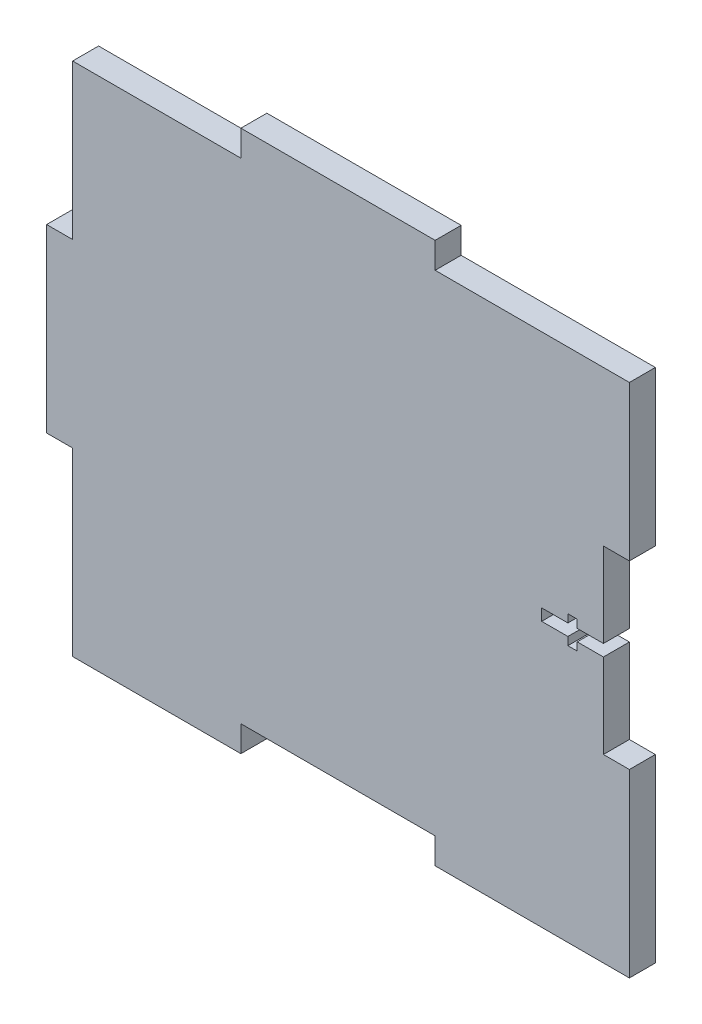
ISO-10303-21;
HEADER;
FILE_DESCRIPTION(('STEP AP214'),'2;1');
FILE_NAME('part.step','',(''),(''),'','','');
FILE_SCHEMA(('AUTOMOTIVE_DESIGN { 1 0 10303 214 1 1 1 1 }'));
ENDSEC;
DATA;
#1=APPLICATION_CONTEXT('core data for automotive mechanical design processes');
#2=APPLICATION_PROTOCOL_DEFINITION('international standard','automotive_design',2000,#1);
#3=PRODUCT_CONTEXT('',#1,'mechanical');
#4=PRODUCT('Part','Part','',(#3));
#5=PRODUCT_RELATED_PRODUCT_CATEGORY('part','',(#4));
#6=PRODUCT_DEFINITION_FORMATION('','',#4);
#7=PRODUCT_DEFINITION_CONTEXT('part definition',#1,'design');
#8=PRODUCT_DEFINITION('design','',#6,#7);
#9=PRODUCT_DEFINITION_SHAPE('','',#8);
#10=(LENGTH_UNIT() NAMED_UNIT(*) SI_UNIT(.MILLI.,.METRE.));
#11=(NAMED_UNIT(*) PLANE_ANGLE_UNIT() SI_UNIT($,.RADIAN.));
#12=(NAMED_UNIT(*) SI_UNIT($,.STERADIAN.) SOLID_ANGLE_UNIT());
#13=UNCERTAINTY_MEASURE_WITH_UNIT(LENGTH_MEASURE(1.E-05),#10,'distance_accuracy_value','');
#14=(GEOMETRIC_REPRESENTATION_CONTEXT(3) GLOBAL_UNCERTAINTY_ASSIGNED_CONTEXT((#13)) GLOBAL_UNIT_ASSIGNED_CONTEXT((#10,
#11,#12)) REPRESENTATION_CONTEXT('',''));
#15=CARTESIAN_POINT('',(0.,0.,0.));
#16=DIRECTION('',(0.,0.,1.));
#17=DIRECTION('',(1.,0.,0.));
#18=AXIS2_PLACEMENT_3D('',#15,#16,#17);
#19=CARTESIAN_POINT('',(64.9732,-60.4012,5.7912));
#20=DIRECTION('',(-1.,0.,0.));
#21=DIRECTION('',(0.,0.,1.));
#22=AXIS2_PLACEMENT_3D('',#19,#20,#21);
#23=PLANE('',#22);
#24=DIRECTION('',(0.,0.,1.));
#25=VECTOR('',#24,1.);
#26=CARTESIAN_POINT('',(64.9732000000014,54.609999999998,9.78384040450919E-13));
#27=LINE('',#26,#25);
#28=CARTESIAN_POINT('',(64.9732000000014,54.609999999998,9.78384040450919E-13));
#29=VERTEX_POINT('',#28);
#30=CARTESIAN_POINT('',(64.9732000000014,54.6099999999979,5.7912));
#31=VERTEX_POINT('',#30);
#32=EDGE_CURVE('E304',#29,#31,#27,.T.);
#33=ORIENTED_EDGE('',*,*,#32,.T.);
#34=DIRECTION('',(0.,1.,0.));
#35=VECTOR('',#34,1.);
#36=CARTESIAN_POINT('',(64.9732,-60.4012,5.7912));
#37=LINE('',#36,#35);
#38=CARTESIAN_POINT('',(64.9732,20.1337333333333,5.7912));
#39=VERTEX_POINT('',#38);
#40=EDGE_CURVE('E447',#39,#31,#37,.T.);
#41=ORIENTED_EDGE('',*,*,#40,.F.);
#42=DIRECTION('',(0.,0.,-1.));
#43=VECTOR('',#42,1.);
#44=CARTESIAN_POINT('',(64.9732,20.1337333333333,5.7912));
#45=LINE('',#44,#43);
#46=CARTESIAN_POINT('',(64.9732,20.1337333333333,0.));
#47=VERTEX_POINT('',#46);
#48=EDGE_CURVE('E406',#39,#47,#45,.T.);
#49=ORIENTED_EDGE('',*,*,#48,.T.);
#50=DIRECTION('',(0.,1.,0.));
#51=VECTOR('',#50,1.);
#52=CARTESIAN_POINT('',(64.9732,-60.4012,0.));
#53=LINE('',#52,#51);
#54=EDGE_CURVE('E435',#47,#29,#53,.T.);
#55=ORIENTED_EDGE('',*,*,#54,.T.);
#56=EDGE_LOOP('',(#33,#41,#49,#55));
#57=FACE_BOUND('',#56,.T.);
#58=ADVANCED_FACE('F35',(#57),#23,.F.);
#59=CARTESIAN_POINT('',(-64.9732,60.4012,5.7912));
#60=DIRECTION('',(0.,-1.,0.));
#61=DIRECTION('',(0.,0.,-1.));
#62=AXIS2_PLACEMENT_3D('',#59,#60,#61);
#63=PLANE('',#62);
#64=DIRECTION('',(0.,0.,1.));
#65=VECTOR('',#64,1.);
#66=CARTESIAN_POINT('',(21.6577333333347,60.401199999998,9.85322934354826E-13));
#67=LINE('',#66,#65);
#68=CARTESIAN_POINT('',(21.6577333333347,60.401199999998,9.85322934354826E-13));
#69=VERTEX_POINT('',#68);
#70=CARTESIAN_POINT('',(21.6577333333347,60.401199999998,5.79120000000098));
#71=VERTEX_POINT('',#70);
#72=EDGE_CURVE('E283',#69,#71,#67,.T.);
#73=ORIENTED_EDGE('',*,*,#72,.F.);
#74=DIRECTION('',(-1.,0.,0.));
#75=VECTOR('',#74,1.);
#76=CARTESIAN_POINT('',(-64.9732,60.4012,0.));
#77=LINE('',#76,#75);
#78=CARTESIAN_POINT('',(-21.657733333332,60.401199999998,9.57567358739198E-13));
#79=VERTEX_POINT('',#78);
#80=EDGE_CURVE('E458',#69,#79,#77,.T.);
#81=ORIENTED_EDGE('',*,*,#80,.T.);
#82=DIRECTION('',(0.,0.,-1.));
#83=VECTOR('',#82,1.);
#84=CARTESIAN_POINT('',(-21.657733333332,60.401199999998,9.57567358739198E-13));
#85=LINE('',#84,#83);
#86=CARTESIAN_POINT('',(-21.657733333332,60.401199999998,5.79120000000095));
#87=VERTEX_POINT('',#86);
#88=EDGE_CURVE('E285',#87,#79,#85,.T.);
#89=ORIENTED_EDGE('',*,*,#88,.F.);
#90=DIRECTION('',(-1.,0.,0.));
#91=VECTOR('',#90,1.);
#92=CARTESIAN_POINT('',(-64.9732,60.4012,5.7912));
#93=LINE('',#92,#91);
#94=EDGE_CURVE('E446',#71,#87,#93,.T.);
#95=ORIENTED_EDGE('',*,*,#94,.F.);
#96=EDGE_LOOP('',(#73,#81,#89,#95));
#97=FACE_BOUND('',#96,.T.);
#98=ADVANCED_FACE('F525',(#97),#63,.F.);
#99=CARTESIAN_POINT('',(-64.9732,-60.4012,5.7912));
#100=DIRECTION('',(1.,0.,0.));
#101=DIRECTION('',(0.,0.,-1.));
#102=AXIS2_PLACEMENT_3D('',#99,#100,#101);
#103=PLANE('',#102);
#104=DIRECTION('',(0.,0.,1.));
#105=VECTOR('',#104,1.);
#106=CARTESIAN_POINT('',(-64.9732,-20.1337333333354,5.48172618408671E-13));
#107=LINE('',#106,#105);
#108=CARTESIAN_POINT('',(-64.9732,-20.1337333333354,0.));
#109=VERTEX_POINT('',#108);
#110=CARTESIAN_POINT('',(-64.9732,-20.1337333333354,5.79120000000054));
#111=VERTEX_POINT('',#110);
#112=EDGE_CURVE('E535',#109,#111,#107,.T.);
#113=ORIENTED_EDGE('',*,*,#112,.T.);
#114=DIRECTION('',(0.,-1.,0.));
#115=VECTOR('',#114,1.);
#116=CARTESIAN_POINT('',(-64.9732,-60.4012,5.7912));
#117=LINE('',#116,#115);
#118=CARTESIAN_POINT('',(-64.9731999999999,20.1337333333312,5.79120000000072));
#119=VERTEX_POINT('',#118);
#120=EDGE_CURVE('E270',#119,#111,#117,.T.);
#121=ORIENTED_EDGE('',*,*,#120,.F.);
#122=DIRECTION('',(0.,0.,-1.));
#123=VECTOR('',#122,1.);
#124=CARTESIAN_POINT('',(-64.9731999999999,20.1337333333313,7.28583859910259E-13));
#125=LINE('',#124,#123);
#126=CARTESIAN_POINT('',(-64.9731999999999,20.1337333333313,7.28583859910259E-13));
#127=VERTEX_POINT('',#126);
#128=EDGE_CURVE('E264',#119,#127,#125,.T.);
#129=ORIENTED_EDGE('',*,*,#128,.T.);
#130=DIRECTION('',(0.,-1.,0.));
#131=VECTOR('',#130,1.);
#132=CARTESIAN_POINT('',(-64.9732,-60.4012,0.));
#133=LINE('',#132,#131);
#134=EDGE_CURVE('E461',#127,#109,#133,.T.);
#135=ORIENTED_EDGE('',*,*,#134,.T.);
#136=EDGE_LOOP('',(#113,#121,#129,#135));
#137=FACE_BOUND('',#136,.T.);
#138=ADVANCED_FACE('F534',(#137),#103,.F.);
#139=CARTESIAN_POINT('',(0.,0.,5.7912));
#140=DIRECTION('',(0.,0.,-1.));
#141=DIRECTION('',(-1.,0.,0.));
#142=AXIS2_PLACEMENT_3D('',#139,#140,#141);
#143=PLANE('',#142);
#144=DIRECTION('',(-1.,0.,0.));
#145=VECTOR('',#144,1.);
#146=CARTESIAN_POINT('',(-59.182,-20.1337333333354,5.79120000000054));
#147=LINE('',#146,#145);
#148=CARTESIAN_POINT('',(-59.182,-20.1337333333354,5.79120000000054));
#149=VERTEX_POINT('',#148);
#150=EDGE_CURVE('E259',#149,#111,#147,.T.);
#151=ORIENTED_EDGE('',*,*,#150,.F.);
#152=DIRECTION('',(0.,-1.,0.));
#153=VECTOR('',#152,1.);
#154=CARTESIAN_POINT('',(-59.1819999999999,1.49890030942679E-13,5.7912));
#155=LINE('',#154,#153);
#156=CARTESIAN_POINT('',(-59.1820000000001,-60.4012000000021,5.79120000000002));
#157=VERTEX_POINT('',#156);
#158=EDGE_CURVE('E244',#149,#157,#155,.T.);
#159=ORIENTED_EDGE('',*,*,#158,.T.);
#160=DIRECTION('',(1.,0.,0.));
#161=VECTOR('',#160,1.);
#162=CARTESIAN_POINT('',(-64.9732,-60.4012,5.7912));
#163=LINE('',#162,#161);
#164=CARTESIAN_POINT('',(-21.6577333333333,-60.4012,5.7912));
#165=VERTEX_POINT('',#164);
#166=EDGE_CURVE('E452',#157,#165,#163,.T.);
#167=ORIENTED_EDGE('',*,*,#166,.T.);
#168=DIRECTION('',(0.,1.,0.));
#169=VECTOR('',#168,1.);
#170=CARTESIAN_POINT('',(-21.6577333333333,-60.4012,5.7912));
#171=LINE('',#170,#169);
#172=CARTESIAN_POINT('',(-21.6577333333333,-54.61,5.7912));
#173=VERTEX_POINT('',#172);
#174=EDGE_CURVE('E419',#165,#173,#171,.T.);
#175=ORIENTED_EDGE('',*,*,#174,.T.);
#176=DIRECTION('',(1.,0.,0.));
#177=VECTOR('',#176,1.);
#178=CARTESIAN_POINT('',(21.6577333333333,-54.61,5.7912));
#179=LINE('',#178,#177);
#180=CARTESIAN_POINT('',(21.6577333333333,-54.61,5.7912));
#181=VERTEX_POINT('',#180);
#182=EDGE_CURVE('E423',#173,#181,#179,.T.);
#183=ORIENTED_EDGE('',*,*,#182,.T.);
#184=DIRECTION('',(0.,-1.,0.));
#185=VECTOR('',#184,1.);
#186=CARTESIAN_POINT('',(21.6577333333333,-60.4012,5.7912));
#187=LINE('',#186,#185);
#188=CARTESIAN_POINT('',(21.6577333333333,-60.4012,5.7912));
#189=VERTEX_POINT('',#188);
#190=EDGE_CURVE('E416',#181,#189,#187,.T.);
#191=ORIENTED_EDGE('',*,*,#190,.T.);
#192=CARTESIAN_POINT('',(64.9732,-60.4012,5.7912));
#193=VERTEX_POINT('',#192);
#194=EDGE_CURVE('E451',#189,#193,#163,.T.);
#195=ORIENTED_EDGE('',*,*,#194,.T.);
#196=CARTESIAN_POINT('',(64.9732,-20.1337333333333,5.7912));
#197=VERTEX_POINT('',#196);
#198=EDGE_CURVE('E443',#193,#197,#37,.T.);
#199=ORIENTED_EDGE('',*,*,#198,.T.);
#200=DIRECTION('',(-1.,0.,0.));
#201=VECTOR('',#200,1.);
#202=CARTESIAN_POINT('',(64.9732,-20.1337333333333,5.7912));
#203=LINE('',#202,#201);
#204=CARTESIAN_POINT('',(59.182,-20.1337333333333,5.7912));
#205=VERTEX_POINT('',#204);
#206=EDGE_CURVE('E387',#197,#205,#203,.T.);
#207=ORIENTED_EDGE('',*,*,#206,.T.);
#208=DIRECTION('',(0.,1.,0.));
#209=VECTOR('',#208,1.);
#210=CARTESIAN_POINT('',(59.182,20.1337333333333,5.7912));
#211=LINE('',#210,#209);
#212=CARTESIAN_POINT('',(59.182,-1.30175,5.7912));
#213=VERTEX_POINT('',#212);
#214=EDGE_CURVE('E392',#205,#213,#211,.T.);
#215=ORIENTED_EDGE('',*,*,#214,.T.);
#216=DIRECTION('',(-1.,0.,0.));
#217=VECTOR('',#216,1.);
#218=CARTESIAN_POINT('',(59.182,-1.30175,5.7912));
#219=LINE('',#218,#217);
#220=CARTESIAN_POINT('',(53.34,-1.30175,5.7912));
#221=VERTEX_POINT('',#220);
#222=EDGE_CURVE('E355',#213,#221,#219,.T.);
#223=ORIENTED_EDGE('',*,*,#222,.T.);
#224=DIRECTION('',(0.,-1.,0.));
#225=VECTOR('',#224,1.);
#226=CARTESIAN_POINT('',(53.34,3.08609999999997,5.7912));
#227=LINE('',#226,#225);
#228=CARTESIAN_POINT('',(53.34,-3.08610000000003,5.7912));
#229=VERTEX_POINT('',#228);
#230=EDGE_CURVE('E319',#221,#229,#227,.T.);
#231=ORIENTED_EDGE('',*,*,#230,.T.);
#232=DIRECTION('',(-1.,0.,0.));
#233=VECTOR('',#232,1.);
#234=CARTESIAN_POINT('',(51.2572,-3.08610000000003,5.7912));
#235=LINE('',#234,#233);
#236=CARTESIAN_POINT('',(51.2572,-3.08610000000003,5.7912));
#237=VERTEX_POINT('',#236);
#238=EDGE_CURVE('E323',#229,#237,#235,.T.);
#239=ORIENTED_EDGE('',*,*,#238,.T.);
#240=DIRECTION('',(0.,1.,0.));
#241=VECTOR('',#240,1.);
#242=CARTESIAN_POINT('',(51.2572,3.08609999999997,5.7912));
#243=LINE('',#242,#241);
#244=CARTESIAN_POINT('',(51.2572,-1.30175,5.7912));
#245=VERTEX_POINT('',#244);
#246=EDGE_CURVE('E312',#237,#245,#243,.T.);
#247=ORIENTED_EDGE('',*,*,#246,.T.);
#248=CARTESIAN_POINT('',(45.4152,-1.30175,5.7912));
#249=VERTEX_POINT('',#248);
#250=EDGE_CURVE('E359',#245,#249,#219,.T.);
#251=ORIENTED_EDGE('',*,*,#250,.T.);
#252=DIRECTION('',(0.,1.,0.));
#253=VECTOR('',#252,1.);
#254=CARTESIAN_POINT('',(45.4152,1.30175,5.7912));
#255=LINE('',#254,#253);
#256=CARTESIAN_POINT('',(45.4152,1.30175,5.7912));
#257=VERTEX_POINT('',#256);
#258=EDGE_CURVE('E358',#249,#257,#255,.T.);
#259=ORIENTED_EDGE('',*,*,#258,.T.);
#260=DIRECTION('',(1.,0.,0.));
#261=VECTOR('',#260,1.);
#262=CARTESIAN_POINT('',(59.182,1.30175,5.7912));
#263=LINE('',#262,#261);
#264=CARTESIAN_POINT('',(51.2572,1.30175,5.7912));
#265=VERTEX_POINT('',#264);
#266=EDGE_CURVE('E363',#257,#265,#263,.T.);
#267=ORIENTED_EDGE('',*,*,#266,.T.);
#268=CARTESIAN_POINT('',(51.2572,3.08609999999997,5.7912));
#269=VERTEX_POINT('',#268);
#270=EDGE_CURVE('E316',#265,#269,#243,.T.);
#271=ORIENTED_EDGE('',*,*,#270,.T.);
#272=DIRECTION('',(1.,0.,0.));
#273=VECTOR('',#272,1.);
#274=CARTESIAN_POINT('',(51.2572,3.08609999999997,5.7912));
#275=LINE('',#274,#273);
#276=CARTESIAN_POINT('',(53.34,3.08609999999997,5.7912));
#277=VERTEX_POINT('',#276);
#278=EDGE_CURVE('E315',#269,#277,#275,.T.);
#279=ORIENTED_EDGE('',*,*,#278,.T.);
#280=CARTESIAN_POINT('',(53.34,1.30175,5.7912));
#281=VERTEX_POINT('',#280);
#282=EDGE_CURVE('E320',#277,#281,#227,.T.);
#283=ORIENTED_EDGE('',*,*,#282,.T.);
#284=CARTESIAN_POINT('',(59.182,1.30175,5.7912));
#285=VERTEX_POINT('',#284);
#286=EDGE_CURVE('E362',#281,#285,#263,.T.);
#287=ORIENTED_EDGE('',*,*,#286,.T.);
#288=CARTESIAN_POINT('',(59.182,20.1337333333333,5.7912));
#289=VERTEX_POINT('',#288);
#290=EDGE_CURVE('E390',#285,#289,#211,.T.);
#291=ORIENTED_EDGE('',*,*,#290,.T.);
#292=DIRECTION('',(1.,0.,0.));
#293=VECTOR('',#292,1.);
#294=CARTESIAN_POINT('',(64.9732,20.1337333333333,5.7912));
#295=LINE('',#294,#293);
#296=EDGE_CURVE('E395',#289,#39,#295,.T.);
#297=ORIENTED_EDGE('',*,*,#296,.T.);
#298=ORIENTED_EDGE('',*,*,#40,.T.);
#299=DIRECTION('',(1.,0.,0.));
#300=VECTOR('',#299,1.);
#301=CARTESIAN_POINT('',(0.,54.609999999998,5.7912));
#302=LINE('',#301,#300);
#303=CARTESIAN_POINT('',(21.6577333333347,54.609999999998,5.79120000000095));
#304=VERTEX_POINT('',#303);
#305=EDGE_CURVE('E309',#304,#31,#302,.T.);
#306=ORIENTED_EDGE('',*,*,#305,.F.);
#307=DIRECTION('',(0.,-1.,0.));
#308=VECTOR('',#307,1.);
#309=CARTESIAN_POINT('',(21.6577333333347,60.401199999998,5.79120000000098));
#310=LINE('',#309,#308);
#311=EDGE_CURVE('E288',#71,#304,#310,.T.);
#312=ORIENTED_EDGE('',*,*,#311,.F.);
#313=ORIENTED_EDGE('',*,*,#94,.T.);
#314=DIRECTION('',(0.,-1.,0.));
#315=VECTOR('',#314,1.);
#316=CARTESIAN_POINT('',(-21.657733333332,60.401199999998,5.79120000000095));
#317=LINE('',#316,#315);
#318=CARTESIAN_POINT('',(-21.657733333332,54.609999999998,5.79120000000093));
#319=VERTEX_POINT('',#318);
#320=EDGE_CURVE('E298',#87,#319,#317,.T.);
#321=ORIENTED_EDGE('',*,*,#320,.T.);
#322=CARTESIAN_POINT('',(-59.1819999999986,54.609999999998,5.7912));
#323=VERTEX_POINT('',#322);
#324=EDGE_CURVE('E311',#323,#319,#302,.T.);
#325=ORIENTED_EDGE('',*,*,#324,.F.);
#326=CARTESIAN_POINT('',(-59.1819999999999,20.1337333333312,5.79120000000071));
#327=VERTEX_POINT('',#326);
#328=EDGE_CURVE('E254',#323,#327,#155,.T.);
#329=ORIENTED_EDGE('',*,*,#328,.T.);
#330=DIRECTION('',(-1.,0.,0.));
#331=VECTOR('',#330,1.);
#332=CARTESIAN_POINT('',(-59.1819999999999,20.1337333333312,5.79120000000072));
#333=LINE('',#332,#331);
#334=EDGE_CURVE('E271',#327,#119,#333,.T.);
#335=ORIENTED_EDGE('',*,*,#334,.T.);
#336=ORIENTED_EDGE('',*,*,#120,.T.);
#337=EDGE_LOOP('',(#151,#159,#167,#175,#183,#191,#195,#199,#207,#215,#223,#231,#239,#247,#251,
#259,#267,#271,#279,#283,#287,#291,#297,#298,#306,#312,#313,#321,#325,#329,#335,#336));
#338=FACE_BOUND('',#337,.T.);
#339=ADVANCED_FACE('F267',(#338),#143,.F.);
#340=CARTESIAN_POINT('',(0.,0.,0.));
#341=DIRECTION('',(0.,0.,-1.));
#342=DIRECTION('',(-1.,0.,0.));
#343=AXIS2_PLACEMENT_3D('',#340,#341,#342);
#344=PLANE('',#343);
#345=DIRECTION('',(0.,-1.,0.));
#346=VECTOR('',#345,1.);
#347=CARTESIAN_POINT('',(21.6577333333347,60.401199999998,9.85322934354826E-13));
#348=LINE('',#347,#346);
#349=CARTESIAN_POINT('',(21.6577333333347,54.609999999998,0.));
#350=VERTEX_POINT('',#349);
#351=EDGE_CURVE('E291',#69,#350,#348,.T.);
#352=ORIENTED_EDGE('',*,*,#351,.T.);
#353=DIRECTION('',(1.,0.,0.));
#354=VECTOR('',#353,1.);
#355=CARTESIAN_POINT('',(-64.9731999999986,54.609999999998,9.08995101411847E-13));
#356=LINE('',#355,#354);
#357=EDGE_CURVE('E50',#350,#29,#356,.T.);
#358=ORIENTED_EDGE('',*,*,#357,.T.);
#359=ORIENTED_EDGE('',*,*,#54,.F.);
#360=DIRECTION('',(1.,0.,0.));
#361=VECTOR('',#360,1.);
#362=CARTESIAN_POINT('',(64.9732,20.1337333333333,0.));
#363=LINE('',#362,#361);
#364=CARTESIAN_POINT('',(59.182,20.1337333333333,0.));
#365=VERTEX_POINT('',#364);
#366=EDGE_CURVE('E391',#365,#47,#363,.T.);
#367=ORIENTED_EDGE('',*,*,#366,.F.);
#368=DIRECTION('',(0.,1.,0.));
#369=VECTOR('',#368,1.);
#370=CARTESIAN_POINT('',(59.182,20.1337333333333,0.));
#371=LINE('',#370,#369);
#372=CARTESIAN_POINT('',(59.182,1.30175,0.));
#373=VERTEX_POINT('',#372);
#374=EDGE_CURVE('E401',#373,#365,#371,.T.);
#375=ORIENTED_EDGE('',*,*,#374,.F.);
#376=DIRECTION('',(1.,0.,0.));
#377=VECTOR('',#376,1.);
#378=CARTESIAN_POINT('',(59.182,1.30175,0.));
#379=LINE('',#378,#377);
#380=CARTESIAN_POINT('',(53.34,1.30175,0.));
#381=VERTEX_POINT('',#380);
#382=EDGE_CURVE('E373',#381,#373,#379,.T.);
#383=ORIENTED_EDGE('',*,*,#382,.F.);
#384=DIRECTION('',(0.,-1.,0.));
#385=VECTOR('',#384,1.);
#386=CARTESIAN_POINT('',(53.34,3.08609999999997,0.));
#387=LINE('',#386,#385);
#388=CARTESIAN_POINT('',(53.34,3.08609999999997,0.));
#389=VERTEX_POINT('',#388);
#390=EDGE_CURVE('E334',#389,#381,#387,.T.);
#391=ORIENTED_EDGE('',*,*,#390,.F.);
#392=DIRECTION('',(1.,0.,0.));
#393=VECTOR('',#392,1.);
#394=CARTESIAN_POINT('',(51.2572,3.08609999999997,0.));
#395=LINE('',#394,#393);
#396=CARTESIAN_POINT('',(51.2572,3.08609999999997,0.));
#397=VERTEX_POINT('',#396);
#398=EDGE_CURVE('E329',#397,#389,#395,.T.);
#399=ORIENTED_EDGE('',*,*,#398,.F.);
#400=DIRECTION('',(0.,1.,0.));
#401=VECTOR('',#400,1.);
#402=CARTESIAN_POINT('',(51.2572,3.08609999999997,0.));
#403=LINE('',#402,#401);
#404=CARTESIAN_POINT('',(51.2572,1.30175,0.));
#405=VERTEX_POINT('',#404);
#406=EDGE_CURVE('E330',#405,#397,#403,.T.);
#407=ORIENTED_EDGE('',*,*,#406,.F.);
#408=CARTESIAN_POINT('',(45.4152,1.30175,0.));
#409=VERTEX_POINT('',#408);
#410=EDGE_CURVE('E374',#409,#405,#379,.T.);
#411=ORIENTED_EDGE('',*,*,#410,.F.);
#412=DIRECTION('',(0.,1.,0.));
#413=VECTOR('',#412,1.);
#414=CARTESIAN_POINT('',(45.4152,1.30175,0.));
#415=LINE('',#414,#413);
#416=CARTESIAN_POINT('',(45.4152,-1.30175,0.));
#417=VERTEX_POINT('',#416);
#418=EDGE_CURVE('E370',#417,#409,#415,.T.);
#419=ORIENTED_EDGE('',*,*,#418,.F.);
#420=DIRECTION('',(-1.,0.,0.));
#421=VECTOR('',#420,1.);
#422=CARTESIAN_POINT('',(59.182,-1.30175,0.));
#423=LINE('',#422,#421);
#424=CARTESIAN_POINT('',(51.2572,-1.30175,0.));
#425=VERTEX_POINT('',#424);
#426=EDGE_CURVE('E354',#425,#417,#423,.T.);
#427=ORIENTED_EDGE('',*,*,#426,.F.);
#428=CARTESIAN_POINT('',(51.2572,-3.08610000000003,0.));
#429=VERTEX_POINT('',#428);
#430=EDGE_CURVE('E327',#429,#425,#403,.T.);
#431=ORIENTED_EDGE('',*,*,#430,.F.);
#432=DIRECTION('',(-1.,0.,0.));
#433=VECTOR('',#432,1.);
#434=CARTESIAN_POINT('',(51.2572,-3.08610000000003,0.));
#435=LINE('',#434,#433);
#436=CARTESIAN_POINT('',(53.34,-3.08610000000003,0.));
#437=VERTEX_POINT('',#436);
#438=EDGE_CURVE('E336',#437,#429,#435,.T.);
#439=ORIENTED_EDGE('',*,*,#438,.F.);
#440=CARTESIAN_POINT('',(53.34,-1.30175,0.));
#441=VERTEX_POINT('',#440);
#442=EDGE_CURVE('E333',#441,#437,#387,.T.);
#443=ORIENTED_EDGE('',*,*,#442,.F.);
#444=CARTESIAN_POINT('',(59.182,-1.30175,0.));
#445=VERTEX_POINT('',#444);
#446=EDGE_CURVE('E367',#445,#441,#423,.T.);
#447=ORIENTED_EDGE('',*,*,#446,.F.);
#448=CARTESIAN_POINT('',(59.182,-20.1337333333333,0.));
#449=VERTEX_POINT('',#448);
#450=EDGE_CURVE('E402',#449,#445,#371,.T.);
#451=ORIENTED_EDGE('',*,*,#450,.F.);
#452=DIRECTION('',(-1.,0.,0.));
#453=VECTOR('',#452,1.);
#454=CARTESIAN_POINT('',(64.9732,-20.1337333333333,0.));
#455=LINE('',#454,#453);
#456=CARTESIAN_POINT('',(64.9732,-20.1337333333333,0.));
#457=VERTEX_POINT('',#456);
#458=EDGE_CURVE('E380',#457,#449,#455,.T.);
#459=ORIENTED_EDGE('',*,*,#458,.F.);
#460=CARTESIAN_POINT('',(64.9732,-60.4012,0.));
#461=VERTEX_POINT('',#460);
#462=EDGE_CURVE('E455',#461,#457,#53,.T.);
#463=ORIENTED_EDGE('',*,*,#462,.F.);
#464=DIRECTION('',(1.,0.,0.));
#465=VECTOR('',#464,1.);
#466=CARTESIAN_POINT('',(-64.9732,-60.4012,0.));
#467=LINE('',#466,#465);
#468=CARTESIAN_POINT('',(21.6577333333333,-60.4012,0.));
#469=VERTEX_POINT('',#468);
#470=EDGE_CURVE('E464',#469,#461,#467,.T.);
#471=ORIENTED_EDGE('',*,*,#470,.F.);
#472=DIRECTION('',(0.,-1.,0.));
#473=VECTOR('',#472,1.);
#474=CARTESIAN_POINT('',(21.6577333333333,-60.4012,0.));
#475=LINE('',#474,#473);
#476=CARTESIAN_POINT('',(21.6577333333333,-54.61,0.));
#477=VERTEX_POINT('',#476);
#478=EDGE_CURVE('E409',#477,#469,#475,.T.);
#479=ORIENTED_EDGE('',*,*,#478,.F.);
#480=DIRECTION('',(1.,0.,0.));
#481=VECTOR('',#480,1.);
#482=CARTESIAN_POINT('',(21.6577333333333,-54.61,0.));
#483=LINE('',#482,#481);
#484=CARTESIAN_POINT('',(-21.6577333333333,-54.61,0.));
#485=VERTEX_POINT('',#484);
#486=EDGE_CURVE('E420',#485,#477,#483,.T.);
#487=ORIENTED_EDGE('',*,*,#486,.F.);
#488=DIRECTION('',(0.,1.,0.));
#489=VECTOR('',#488,1.);
#490=CARTESIAN_POINT('',(-21.6577333333333,-60.4012,0.));
#491=LINE('',#490,#489);
#492=CARTESIAN_POINT('',(-21.6577333333333,-60.4012,0.));
#493=VERTEX_POINT('',#492);
#494=EDGE_CURVE('E428',#493,#485,#491,.T.);
#495=ORIENTED_EDGE('',*,*,#494,.F.);
#496=CARTESIAN_POINT('',(-59.1820000000001,-60.4012000000021,3.7470027081099E-13));
#497=VERTEX_POINT('',#496);
#498=EDGE_CURVE('E465',#497,#493,#467,.T.);
#499=ORIENTED_EDGE('',*,*,#498,.F.);
#500=DIRECTION('',(0.,-1.,0.));
#501=VECTOR('',#500,1.);
#502=CARTESIAN_POINT('',(-59.1820000000001,-60.4012000000021,3.7470027081099E-13));
#503=LINE('',#502,#501);
#504=CARTESIAN_POINT('',(-59.182,-20.1337333333354,5.48172618408671E-13));
#505=VERTEX_POINT('',#504);
#506=EDGE_CURVE('E280',#505,#497,#503,.T.);
#507=ORIENTED_EDGE('',*,*,#506,.F.);
#508=DIRECTION('',(-1.,0.,0.));
#509=VECTOR('',#508,1.);
#510=CARTESIAN_POINT('',(-59.182,-20.1337333333354,5.48172618408671E-13));
#511=LINE('',#510,#509);
#512=EDGE_CURVE('E262',#505,#109,#511,.T.);
#513=ORIENTED_EDGE('',*,*,#512,.T.);
#514=ORIENTED_EDGE('',*,*,#134,.F.);
#515=DIRECTION('',(-1.,0.,0.));
#516=VECTOR('',#515,1.);
#517=CARTESIAN_POINT('',(-59.1819999999999,20.1337333333313,7.28583859910259E-13));
#518=LINE('',#517,#516);
#519=CARTESIAN_POINT('',(-59.1819999999999,20.1337333333313,0.));
#520=VERTEX_POINT('',#519);
#521=EDGE_CURVE('E273',#520,#127,#518,.T.);
#522=ORIENTED_EDGE('',*,*,#521,.F.);
#523=CARTESIAN_POINT('',(-59.1819999999998,54.609999999998,9.12209863201951E-13));
#524=VERTEX_POINT('',#523);
#525=EDGE_CURVE('E278',#524,#520,#503,.T.);
#526=ORIENTED_EDGE('',*,*,#525,.F.);
#527=CARTESIAN_POINT('',(-21.657733333332,54.609999999998,9.29811783123569E-13));
#528=VERTEX_POINT('',#527);
#529=EDGE_CURVE('E255',#524,#528,#356,.T.);
#530=ORIENTED_EDGE('',*,*,#529,.T.);
#531=DIRECTION('',(0.,-1.,0.));
#532=VECTOR('',#531,1.);
#533=CARTESIAN_POINT('',(-21.657733333332,60.401199999998,9.57567358739198E-13));
#534=LINE('',#533,#532);
#535=EDGE_CURVE('E295',#79,#528,#534,.T.);
#536=ORIENTED_EDGE('',*,*,#535,.F.);
#537=ORIENTED_EDGE('',*,*,#80,.F.);
#538=EDGE_LOOP('',(#352,#358,#359,#367,#375,#383,#391,#399,#407,#411,#419,#427,#431,#439,#443,
#447,#451,#459,#463,#471,#479,#487,#495,#499,#507,#513,#514,#522,#526,#530,#536,#537));
#539=FACE_BOUND('',#538,.T.);
#540=ADVANCED_FACE('F481',(#539),#344,.T.);
#541=CARTESIAN_POINT('',(59.182,1.30175,5.7912));
#542=DIRECTION('',(0.,1.,0.));
#543=DIRECTION('',(0.,0.,1.));
#544=AXIS2_PLACEMENT_3D('',#541,#542,#543);
#545=PLANE('',#544);
#546=ORIENTED_EDGE('',*,*,#410,.T.);
#547=DIRECTION('',(0.,0.,1.));
#548=VECTOR('',#547,1.);
#549=CARTESIAN_POINT('',(51.2572,1.30175,5.7912));
#550=LINE('',#549,#548);
#551=EDGE_CURVE('E351',#405,#265,#550,.T.);
#552=ORIENTED_EDGE('',*,*,#551,.T.);
#553=ORIENTED_EDGE('',*,*,#266,.F.);
#554=DIRECTION('',(0.,0.,-1.));
#555=VECTOR('',#554,1.);
#556=CARTESIAN_POINT('',(45.4152,1.30175,5.7912));
#557=LINE('',#556,#555);
#558=EDGE_CURVE('E381',#257,#409,#557,.T.);
#559=ORIENTED_EDGE('',*,*,#558,.T.);
#560=EDGE_LOOP('',(#546,#552,#553,#559));
#561=FACE_BOUND('',#560,.T.);
#562=ADVANCED_FACE('F503',(#561),#545,.F.);
#563=CARTESIAN_POINT('',(59.182,-1.30175,5.7912));
#564=DIRECTION('',(0.,-1.,0.));
#565=DIRECTION('',(0.,0.,-1.));
#566=AXIS2_PLACEMENT_3D('',#563,#564,#565);
#567=PLANE('',#566);
#568=ORIENTED_EDGE('',*,*,#250,.F.);
#569=DIRECTION('',(0.,0.,-1.));
#570=VECTOR('',#569,1.);
#571=CARTESIAN_POINT('',(51.2572,-1.30175,5.7912));
#572=LINE('',#571,#570);
#573=EDGE_CURVE('E11',#245,#425,#572,.T.);
#574=ORIENTED_EDGE('',*,*,#573,.T.);
#575=ORIENTED_EDGE('',*,*,#426,.T.);
#576=DIRECTION('',(0.,0.,-1.));
#577=VECTOR('',#576,1.);
#578=CARTESIAN_POINT('',(45.4152,-1.30175,5.7912));
#579=LINE('',#578,#577);
#580=EDGE_CURVE('E383',#249,#417,#579,.T.);
#581=ORIENTED_EDGE('',*,*,#580,.F.);
#582=EDGE_LOOP('',(#568,#574,#575,#581));
#583=FACE_BOUND('',#582,.T.);
#584=ADVANCED_FACE('F494',(#583),#567,.F.);
#585=CARTESIAN_POINT('',(59.182,20.1337333333333,5.7912));
#586=DIRECTION('',(-1.,0.,0.));
#587=DIRECTION('',(0.,-1.,0.));
#588=AXIS2_PLACEMENT_3D('',#585,#586,#587);
#589=PLANE('',#588);
#590=ORIENTED_EDGE('',*,*,#290,.F.);
#591=DIRECTION('',(0.,0.,-1.));
#592=VECTOR('',#591,1.);
#593=CARTESIAN_POINT('',(59.182,1.30175,5.7912));
#594=LINE('',#593,#592);
#595=EDGE_CURVE('E377',#285,#373,#594,.T.);
#596=ORIENTED_EDGE('',*,*,#595,.T.);
#597=ORIENTED_EDGE('',*,*,#374,.T.);
#598=DIRECTION('',(0.,0.,-1.));
#599=VECTOR('',#598,1.);
#600=CARTESIAN_POINT('',(59.182,20.1337333333333,5.7912));
#601=LINE('',#600,#599);
#602=EDGE_CURVE('E410',#289,#365,#601,.T.);
#603=ORIENTED_EDGE('',*,*,#602,.F.);
#604=EDGE_LOOP('',(#590,#596,#597,#603));
#605=FACE_BOUND('',#604,.T.);
#606=ADVANCED_FACE('F568',(#605),#589,.F.);
#607=CARTESIAN_POINT('',(-64.9732,-60.4012,5.7912));
#608=DIRECTION('',(0.,1.,0.));
#609=DIRECTION('',(0.,0.,1.));
#610=AXIS2_PLACEMENT_3D('',#607,#608,#609);
#611=PLANE('',#610);
#612=ORIENTED_EDGE('',*,*,#194,.F.);
#613=DIRECTION('',(0.,0.,-1.));
#614=VECTOR('',#613,1.);
#615=CARTESIAN_POINT('',(21.6577333333333,-60.4012,5.7912));
#616=LINE('',#615,#614);
#617=EDGE_CURVE('E426',#189,#469,#616,.T.);
#618=ORIENTED_EDGE('',*,*,#617,.T.);
#619=ORIENTED_EDGE('',*,*,#470,.T.);
#620=DIRECTION('',(0.,0.,-1.));
#621=VECTOR('',#620,1.);
#622=CARTESIAN_POINT('',(64.9732,-60.4012,5.7912));
#623=LINE('',#622,#621);
#624=EDGE_CURVE('E454',#193,#461,#623,.T.);
#625=ORIENTED_EDGE('',*,*,#624,.F.);
#626=EDGE_LOOP('',(#612,#618,#619,#625));
#627=FACE_BOUND('',#626,.T.);
#628=ADVANCED_FACE('F559',(#627),#611,.F.);
#629=ORIENTED_EDGE('',*,*,#462,.T.);
#630=DIRECTION('',(0.,0.,-1.));
#631=VECTOR('',#630,1.);
#632=CARTESIAN_POINT('',(64.9732,-20.1337333333333,5.7912));
#633=LINE('',#632,#631);
#634=EDGE_CURVE('E398',#197,#457,#633,.T.);
#635=ORIENTED_EDGE('',*,*,#634,.F.);
#636=ORIENTED_EDGE('',*,*,#198,.F.);
#637=ORIENTED_EDGE('',*,*,#624,.T.);
#638=EDGE_LOOP('',(#629,#635,#636,#637));
#639=FACE_BOUND('',#638,.T.);
#640=ADVANCED_FACE('F37',(#639),#23,.F.);
#641=ORIENTED_EDGE('',*,*,#166,.F.);
#642=DIRECTION('',(0.,0.,1.));
#643=VECTOR('',#642,1.);
#644=CARTESIAN_POINT('',(-59.1820000000001,-60.4012000000024,83.9724000000004));
#645=LINE('',#644,#643);
#646=EDGE_CURVE('E250',#497,#157,#645,.T.);
#647=ORIENTED_EDGE('',*,*,#646,.F.);
#648=ORIENTED_EDGE('',*,*,#498,.T.);
#649=DIRECTION('',(0.,0.,-1.));
#650=VECTOR('',#649,1.);
#651=CARTESIAN_POINT('',(-21.6577333333333,-60.4012,5.7912));
#652=LINE('',#651,#650);
#653=EDGE_CURVE('E438',#165,#493,#652,.T.);
#654=ORIENTED_EDGE('',*,*,#653,.F.);
#655=EDGE_LOOP('',(#641,#647,#648,#654));
#656=FACE_BOUND('',#655,.T.);
#657=ADVANCED_FACE('F558',(#656),#611,.F.);
#658=CARTESIAN_POINT('',(21.6577333333333,-60.4012,5.7912));
#659=DIRECTION('',(1.,0.,0.));
#660=DIRECTION('',(0.,0.,-1.));
#661=AXIS2_PLACEMENT_3D('',#658,#659,#660);
#662=PLANE('',#661);
#663=ORIENTED_EDGE('',*,*,#478,.T.);
#664=ORIENTED_EDGE('',*,*,#617,.F.);
#665=ORIENTED_EDGE('',*,*,#190,.F.);
#666=DIRECTION('',(0.,0.,-1.));
#667=VECTOR('',#666,1.);
#668=CARTESIAN_POINT('',(21.6577333333333,-54.61,5.7912));
#669=LINE('',#668,#667);
#670=EDGE_CURVE('E433',#181,#477,#669,.T.);
#671=ORIENTED_EDGE('',*,*,#670,.T.);
#672=EDGE_LOOP('',(#663,#664,#665,#671));
#673=FACE_BOUND('',#672,.T.);
#674=ADVANCED_FACE('F565',(#673),#662,.F.);
#675=CARTESIAN_POINT('',(21.6577333333333,-54.61,5.7912));
#676=DIRECTION('',(0.,1.,0.));
#677=DIRECTION('',(0.,0.,1.));
#678=AXIS2_PLACEMENT_3D('',#675,#676,#677);
#679=PLANE('',#678);
#680=ORIENTED_EDGE('',*,*,#486,.T.);
#681=ORIENTED_EDGE('',*,*,#670,.F.);
#682=ORIENTED_EDGE('',*,*,#182,.F.);
#683=DIRECTION('',(0.,0.,-1.));
#684=VECTOR('',#683,1.);
#685=CARTESIAN_POINT('',(-21.6577333333333,-54.61,5.7912));
#686=LINE('',#685,#684);
#687=EDGE_CURVE('E436',#173,#485,#686,.T.);
#688=ORIENTED_EDGE('',*,*,#687,.T.);
#689=EDGE_LOOP('',(#680,#681,#682,#688));
#690=FACE_BOUND('',#689,.T.);
#691=ADVANCED_FACE('F591',(#690),#679,.F.);
#692=CARTESIAN_POINT('',(-21.6577333333333,-60.4012,5.7912));
#693=DIRECTION('',(-1.,0.,0.));
#694=DIRECTION('',(0.,0.,1.));
#695=AXIS2_PLACEMENT_3D('',#692,#693,#694);
#696=PLANE('',#695);
#697=ORIENTED_EDGE('',*,*,#494,.T.);
#698=ORIENTED_EDGE('',*,*,#687,.F.);
#699=ORIENTED_EDGE('',*,*,#174,.F.);
#700=ORIENTED_EDGE('',*,*,#653,.T.);
#701=EDGE_LOOP('',(#697,#698,#699,#700));
#702=FACE_BOUND('',#701,.T.);
#703=ADVANCED_FACE('F594',(#702),#696,.F.);
#704=CARTESIAN_POINT('',(64.9732,20.1337333333333,5.7912));
#705=DIRECTION('',(0.,1.,0.));
#706=DIRECTION('',(0.,0.,1.));
#707=AXIS2_PLACEMENT_3D('',#704,#705,#706);
#708=PLANE('',#707);
#709=ORIENTED_EDGE('',*,*,#366,.T.);
#710=ORIENTED_EDGE('',*,*,#48,.F.);
#711=ORIENTED_EDGE('',*,*,#296,.F.);
#712=ORIENTED_EDGE('',*,*,#602,.T.);
#713=EDGE_LOOP('',(#709,#710,#711,#712));
#714=FACE_BOUND('',#713,.T.);
#715=ADVANCED_FACE('F587',(#714),#708,.F.);
#716=ORIENTED_EDGE('',*,*,#450,.T.);
#717=DIRECTION('',(0.,0.,-1.));
#718=VECTOR('',#717,1.);
#719=CARTESIAN_POINT('',(59.182,-1.30175,5.7912));
#720=LINE('',#719,#718);
#721=EDGE_CURVE('E366',#213,#445,#720,.T.);
#722=ORIENTED_EDGE('',*,*,#721,.F.);
#723=ORIENTED_EDGE('',*,*,#214,.F.);
#724=DIRECTION('',(0.,0.,-1.));
#725=VECTOR('',#724,1.);
#726=CARTESIAN_POINT('',(59.182,-20.1337333333333,5.7912));
#727=LINE('',#726,#725);
#728=EDGE_CURVE('E413',#205,#449,#727,.T.);
#729=ORIENTED_EDGE('',*,*,#728,.T.);
#730=EDGE_LOOP('',(#716,#722,#723,#729));
#731=FACE_BOUND('',#730,.T.);
#732=ADVANCED_FACE('F478',(#731),#589,.F.);
#733=CARTESIAN_POINT('',(64.9732,-20.1337333333333,5.7912));
#734=DIRECTION('',(0.,-1.,0.));
#735=DIRECTION('',(0.,0.,-1.));
#736=AXIS2_PLACEMENT_3D('',#733,#734,#735);
#737=PLANE('',#736);
#738=ORIENTED_EDGE('',*,*,#458,.T.);
#739=ORIENTED_EDGE('',*,*,#728,.F.);
#740=ORIENTED_EDGE('',*,*,#206,.F.);
#741=ORIENTED_EDGE('',*,*,#634,.T.);
#742=EDGE_LOOP('',(#738,#739,#740,#741));
#743=FACE_BOUND('',#742,.T.);
#744=ADVANCED_FACE('F577',(#743),#737,.F.);
#745=ORIENTED_EDGE('',*,*,#286,.F.);
#746=DIRECTION('',(0.,0.,-1.));
#747=VECTOR('',#746,1.);
#748=CARTESIAN_POINT('',(53.34,1.30175,5.7912));
#749=LINE('',#748,#747);
#750=EDGE_CURVE('E341',#281,#381,#749,.T.);
#751=ORIENTED_EDGE('',*,*,#750,.T.);
#752=ORIENTED_EDGE('',*,*,#382,.T.);
#753=ORIENTED_EDGE('',*,*,#595,.F.);
#754=EDGE_LOOP('',(#745,#751,#752,#753));
#755=FACE_BOUND('',#754,.T.);
#756=ADVANCED_FACE('F579',(#755),#545,.F.);
#757=CARTESIAN_POINT('',(45.4152,1.30175,5.7912));
#758=DIRECTION('',(-1.,0.,0.));
#759=DIRECTION('',(0.,-1.,0.));
#760=AXIS2_PLACEMENT_3D('',#757,#758,#759);
#761=PLANE('',#760);
#762=ORIENTED_EDGE('',*,*,#418,.T.);
#763=ORIENTED_EDGE('',*,*,#558,.F.);
#764=ORIENTED_EDGE('',*,*,#258,.F.);
#765=ORIENTED_EDGE('',*,*,#580,.T.);
#766=EDGE_LOOP('',(#762,#763,#764,#765));
#767=FACE_BOUND('',#766,.T.);
#768=ADVANCED_FACE('F499',(#767),#761,.F.);
#769=ORIENTED_EDGE('',*,*,#446,.T.);
#770=DIRECTION('',(0.,0.,1.));
#771=VECTOR('',#770,1.);
#772=CARTESIAN_POINT('',(53.34,-1.30175,5.7912));
#773=LINE('',#772,#771);
#774=EDGE_CURVE('E43',#441,#221,#773,.T.);
#775=ORIENTED_EDGE('',*,*,#774,.T.);
#776=ORIENTED_EDGE('',*,*,#222,.F.);
#777=ORIENTED_EDGE('',*,*,#721,.T.);
#778=EDGE_LOOP('',(#769,#775,#776,#777));
#779=FACE_BOUND('',#778,.T.);
#780=ADVANCED_FACE('F470',(#779),#567,.F.);
#781=CARTESIAN_POINT('',(51.2572,3.08609999999997,5.7912));
#782=DIRECTION('',(-1.,0.,0.));
#783=DIRECTION('',(0.,-1.,0.));
#784=AXIS2_PLACEMENT_3D('',#781,#782,#783);
#785=PLANE('',#784);
#786=ORIENTED_EDGE('',*,*,#246,.F.);
#787=DIRECTION('',(0.,0.,-1.));
#788=VECTOR('',#787,1.);
#789=CARTESIAN_POINT('',(51.2572,-3.08610000000003,5.7912));
#790=LINE('',#789,#788);
#791=EDGE_CURVE('E339',#237,#429,#790,.T.);
#792=ORIENTED_EDGE('',*,*,#791,.T.);
#793=ORIENTED_EDGE('',*,*,#430,.T.);
#794=ORIENTED_EDGE('',*,*,#573,.F.);
#795=EDGE_LOOP('',(#786,#792,#793,#794));
#796=FACE_BOUND('',#795,.T.);
#797=ADVANCED_FACE('F703',(#796),#785,.F.);
#798=CARTESIAN_POINT('',(53.34,3.08609999999997,5.7912));
#799=DIRECTION('',(1.,0.,0.));
#800=DIRECTION('',(0.,0.,-1.));
#801=AXIS2_PLACEMENT_3D('',#798,#799,#800);
#802=PLANE('',#801);
#803=ORIENTED_EDGE('',*,*,#442,.T.);
#804=DIRECTION('',(0.,0.,-1.));
#805=VECTOR('',#804,1.);
#806=CARTESIAN_POINT('',(53.34,-3.08610000000003,5.7912));
#807=LINE('',#806,#805);
#808=EDGE_CURVE('E342',#229,#437,#807,.T.);
#809=ORIENTED_EDGE('',*,*,#808,.F.);
#810=ORIENTED_EDGE('',*,*,#230,.F.);
#811=ORIENTED_EDGE('',*,*,#774,.F.);
#812=EDGE_LOOP('',(#803,#809,#810,#811));
#813=FACE_BOUND('',#812,.T.);
#814=ADVANCED_FACE('F485',(#813),#802,.F.);
#815=CARTESIAN_POINT('',(51.2572,-3.08610000000003,5.7912));
#816=DIRECTION('',(0.,-1.,0.));
#817=DIRECTION('',(0.,0.,-1.));
#818=AXIS2_PLACEMENT_3D('',#815,#816,#817);
#819=PLANE('',#818);
#820=ORIENTED_EDGE('',*,*,#438,.T.);
#821=ORIENTED_EDGE('',*,*,#791,.F.);
#822=ORIENTED_EDGE('',*,*,#238,.F.);
#823=ORIENTED_EDGE('',*,*,#808,.T.);
#824=EDGE_LOOP('',(#820,#821,#822,#823));
#825=FACE_BOUND('',#824,.T.);
#826=ADVANCED_FACE('F488',(#825),#819,.F.);
#827=ORIENTED_EDGE('',*,*,#406,.T.);
#828=DIRECTION('',(0.,0.,-1.));
#829=VECTOR('',#828,1.);
#830=CARTESIAN_POINT('',(51.2572,3.08609999999997,5.7912));
#831=LINE('',#830,#829);
#832=EDGE_CURVE('E326',#269,#397,#831,.T.);
#833=ORIENTED_EDGE('',*,*,#832,.F.);
#834=ORIENTED_EDGE('',*,*,#270,.F.);
#835=ORIENTED_EDGE('',*,*,#551,.F.);
#836=EDGE_LOOP('',(#827,#833,#834,#835));
#837=FACE_BOUND('',#836,.T.);
#838=ADVANCED_FACE('F507',(#837),#785,.F.);
#839=ORIENTED_EDGE('',*,*,#282,.F.);
#840=DIRECTION('',(0.,0.,-1.));
#841=VECTOR('',#840,1.);
#842=CARTESIAN_POINT('',(53.34,3.08609999999997,5.7912));
#843=LINE('',#842,#841);
#844=EDGE_CURVE('E345',#277,#389,#843,.T.);
#845=ORIENTED_EDGE('',*,*,#844,.T.);
#846=ORIENTED_EDGE('',*,*,#390,.T.);
#847=ORIENTED_EDGE('',*,*,#750,.F.);
#848=EDGE_LOOP('',(#839,#845,#846,#847));
#849=FACE_BOUND('',#848,.T.);
#850=ADVANCED_FACE('F723',(#849),#802,.F.);
#851=CARTESIAN_POINT('',(51.2572,3.08609999999997,5.7912));
#852=DIRECTION('',(0.,1.,0.));
#853=DIRECTION('',(0.,0.,1.));
#854=AXIS2_PLACEMENT_3D('',#851,#852,#853);
#855=PLANE('',#854);
#856=ORIENTED_EDGE('',*,*,#398,.T.);
#857=ORIENTED_EDGE('',*,*,#844,.F.);
#858=ORIENTED_EDGE('',*,*,#278,.F.);
#859=ORIENTED_EDGE('',*,*,#832,.T.);
#860=EDGE_LOOP('',(#856,#857,#858,#859));
#861=FACE_BOUND('',#860,.T.);
#862=ADVANCED_FACE('F548',(#861),#855,.F.);
#863=CARTESIAN_POINT('',(-21.657733333332,60.401199999998,9.57567358739198E-13));
#864=DIRECTION('',(-1.,0.,0.));
#865=DIRECTION('',(0.,0.,-1.));
#866=AXIS2_PLACEMENT_3D('',#863,#864,#865);
#867=PLANE('',#866);
#868=DIRECTION('',(0.,0.,-1.));
#869=VECTOR('',#868,1.);
#870=CARTESIAN_POINT('',(-21.657733333332,54.609999999998,9.29811783123569E-13));
#871=LINE('',#870,#869);
#872=EDGE_CURVE('E286',#319,#528,#871,.T.);
#873=ORIENTED_EDGE('',*,*,#872,.F.);
#874=ORIENTED_EDGE('',*,*,#320,.F.);
#875=ORIENTED_EDGE('',*,*,#88,.T.);
#876=ORIENTED_EDGE('',*,*,#535,.T.);
#877=EDGE_LOOP('',(#873,#874,#875,#876));
#878=FACE_BOUND('',#877,.T.);
#879=ADVANCED_FACE('F517',(#878),#867,.T.);
#880=CARTESIAN_POINT('',(-59.1819999999999,20.1337333333313,7.28583859910259E-13));
#881=DIRECTION('',(0.,1.,0.));
#882=DIRECTION('',(0.,0.,-1.));
#883=AXIS2_PLACEMENT_3D('',#880,#881,#882);
#884=PLANE('',#883);
#885=ORIENTED_EDGE('',*,*,#128,.F.);
#886=ORIENTED_EDGE('',*,*,#334,.F.);
#887=DIRECTION('',(0.,0.,-1.));
#888=VECTOR('',#887,1.);
#889=CARTESIAN_POINT('',(-59.1819999999999,20.1337333333313,7.28583859910259E-13));
#890=LINE('',#889,#888);
#891=EDGE_CURVE('E58',#327,#520,#890,.T.);
#892=ORIENTED_EDGE('',*,*,#891,.T.);
#893=ORIENTED_EDGE('',*,*,#521,.T.);
#894=EDGE_LOOP('',(#885,#886,#892,#893));
#895=FACE_BOUND('',#894,.T.);
#896=ADVANCED_FACE('F539',(#895),#884,.T.);
#897=CARTESIAN_POINT('',(-59.1819999999999,-2.24820162486594E-12,41.9862000000006));
#898=DIRECTION('',(1.,0.,0.));
#899=DIRECTION('',(0.,-1.,0.));
#900=AXIS2_PLACEMENT_3D('',#897,#898,#899);
#901=PLANE('',#900);
#902=DIRECTION('',(0.,0.,1.));
#903=VECTOR('',#902,1.);
#904=CARTESIAN_POINT('',(-59.1819999999987,54.6099999999977,55.9816000000009));
#905=LINE('',#904,#903);
#906=EDGE_CURVE('E294',#524,#323,#905,.T.);
#907=ORIENTED_EDGE('',*,*,#906,.F.);
#908=ORIENTED_EDGE('',*,*,#525,.T.);
#909=ORIENTED_EDGE('',*,*,#891,.F.);
#910=ORIENTED_EDGE('',*,*,#328,.F.);
#911=EDGE_LOOP('',(#907,#908,#909,#910));
#912=FACE_BOUND('',#911,.T.);
#913=ADVANCED_FACE('F531',(#912),#901,.F.);
#914=CARTESIAN_POINT('',(1.37289637991422E-12,54.6099999999978,41.9862000000009));
#915=DIRECTION('',(0.,1.,0.));
#916=DIRECTION('',(-1.,0.,0.));
#917=AXIS2_PLACEMENT_3D('',#914,#915,#916);
#918=PLANE('',#917);
#919=ORIENTED_EDGE('',*,*,#324,.T.);
#920=ORIENTED_EDGE('',*,*,#872,.T.);
#921=ORIENTED_EDGE('',*,*,#529,.F.);
#922=ORIENTED_EDGE('',*,*,#906,.T.);
#923=EDGE_LOOP('',(#919,#920,#921,#922));
#924=FACE_BOUND('',#923,.T.);
#925=ADVANCED_FACE('F513',(#924),#918,.T.);
#926=CARTESIAN_POINT('',(-59.182,-20.1337333333354,5.48172618408671E-13));
#927=DIRECTION('',(0.,-1.,0.));
#928=DIRECTION('',(-1.,0.,0.));
#929=AXIS2_PLACEMENT_3D('',#926,#927,#928);
#930=PLANE('',#929);
#931=ORIENTED_EDGE('',*,*,#112,.F.);
#932=ORIENTED_EDGE('',*,*,#512,.F.);
#933=DIRECTION('',(0.,0.,1.));
#934=VECTOR('',#933,1.);
#935=CARTESIAN_POINT('',(-59.182,-20.1337333333354,5.48172618408671E-13));
#936=LINE('',#935,#934);
#937=EDGE_CURVE('E247',#505,#149,#936,.T.);
#938=ORIENTED_EDGE('',*,*,#937,.T.);
#939=ORIENTED_EDGE('',*,*,#150,.T.);
#940=EDGE_LOOP('',(#931,#932,#938,#939));
#941=FACE_BOUND('',#940,.T.);
#942=ADVANCED_FACE('F258',(#941),#930,.T.);
#943=ORIENTED_EDGE('',*,*,#937,.F.);
#944=ORIENTED_EDGE('',*,*,#506,.T.);
#945=ORIENTED_EDGE('',*,*,#646,.T.);
#946=ORIENTED_EDGE('',*,*,#158,.F.);
#947=EDGE_LOOP('',(#943,#944,#945,#946));
#948=FACE_BOUND('',#947,.T.);
#949=ADVANCED_FACE('F246',(#948),#901,.F.);
#950=ORIENTED_EDGE('',*,*,#305,.T.);
#951=ORIENTED_EDGE('',*,*,#32,.F.);
#952=ORIENTED_EDGE('',*,*,#357,.F.);
#953=DIRECTION('',(0.,0.,1.));
#954=VECTOR('',#953,1.);
#955=CARTESIAN_POINT('',(21.6577333333347,54.609999999998,9.57567358739198E-13));
#956=LINE('',#955,#954);
#957=EDGE_CURVE('E282',#350,#304,#956,.T.);
#958=ORIENTED_EDGE('',*,*,#957,.T.);
#959=EDGE_LOOP('',(#950,#951,#952,#958));
#960=FACE_BOUND('',#959,.T.);
#961=ADVANCED_FACE('F787',(#960),#918,.T.);
#962=CARTESIAN_POINT('',(21.6577333333347,60.401199999998,9.85322934354826E-13));
#963=DIRECTION('',(1.,0.,0.));
#964=DIRECTION('',(0.,0.,1.));
#965=AXIS2_PLACEMENT_3D('',#962,#963,#964);
#966=PLANE('',#965);
#967=ORIENTED_EDGE('',*,*,#957,.F.);
#968=ORIENTED_EDGE('',*,*,#351,.F.);
#969=ORIENTED_EDGE('',*,*,#72,.T.);
#970=ORIENTED_EDGE('',*,*,#311,.T.);
#971=EDGE_LOOP('',(#967,#968,#969,#970));
#972=FACE_BOUND('',#971,.T.);
#973=ADVANCED_FACE('F810',(#972),#966,.T.);
#974=CLOSED_SHELL('',(#58,#98,#138,#339,#540,#562,#584,#606,#628,#640,#657,#674,#691,#703,#715,
#732,#744,#756,#768,#780,#797,#814,#826,#838,#850,#862,#879,#896,#913,#925,#942,#949,#961,#973));
#975=MANIFOLD_SOLID_BREP('B2',#974);
#976=ADVANCED_BREP_SHAPE_REPRESENTATION('',(#18,#975),#14);
#977=SHAPE_DEFINITION_REPRESENTATION(#9,#976);
ENDSEC;
END-ISO-10303-21;
